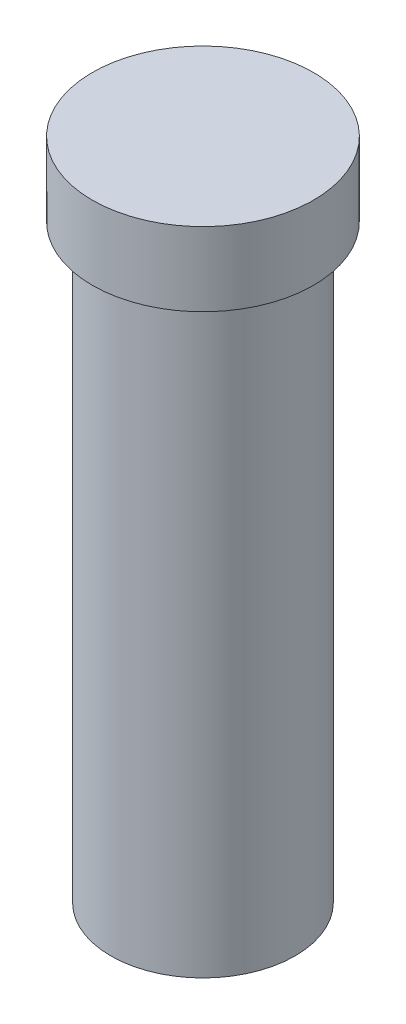
ISO-10303-21;
HEADER;
FILE_DESCRIPTION(('STEP AP214'),'2;1');
FILE_NAME('part.step','',(''),(''),'','','');
FILE_SCHEMA(('AUTOMOTIVE_DESIGN { 1 0 10303 214 1 1 1 1 }'));
ENDSEC;
DATA;
#1=APPLICATION_CONTEXT('core data for automotive mechanical design processes');
#2=APPLICATION_PROTOCOL_DEFINITION('international standard','automotive_design',2000,#1);
#3=PRODUCT_CONTEXT('',#1,'mechanical');
#4=PRODUCT('Part','Part','',(#3));
#5=PRODUCT_RELATED_PRODUCT_CATEGORY('part','',(#4));
#6=PRODUCT_DEFINITION_FORMATION('','',#4);
#7=PRODUCT_DEFINITION_CONTEXT('part definition',#1,'design');
#8=PRODUCT_DEFINITION('design','',#6,#7);
#9=PRODUCT_DEFINITION_SHAPE('','',#8);
#10=(LENGTH_UNIT() NAMED_UNIT(*) SI_UNIT(.MILLI.,.METRE.));
#11=(NAMED_UNIT(*) PLANE_ANGLE_UNIT() SI_UNIT($,.RADIAN.));
#12=(NAMED_UNIT(*) SI_UNIT($,.STERADIAN.) SOLID_ANGLE_UNIT());
#13=UNCERTAINTY_MEASURE_WITH_UNIT(LENGTH_MEASURE(1.E-05),#10,'distance_accuracy_value','');
#14=(GEOMETRIC_REPRESENTATION_CONTEXT(3) GLOBAL_UNCERTAINTY_ASSIGNED_CONTEXT((#13)) GLOBAL_UNIT_ASSIGNED_CONTEXT((#10,
#11,#12)) REPRESENTATION_CONTEXT('',''));
#15=CARTESIAN_POINT('',(0.,0.,0.));
#16=DIRECTION('',(0.,0.,1.));
#17=DIRECTION('',(1.,0.,0.));
#18=AXIS2_PLACEMENT_3D('',#15,#16,#17);
#19=CARTESIAN_POINT('',(0.,45.,0.));
#20=DIRECTION('',(0.,-1.,0.));
#21=DIRECTION('',(0.,0.,-1.));
#22=AXIS2_PLACEMENT_3D('',#19,#20,#21);
#23=CYLINDRICAL_SURFACE('',#22,12.5);
#24=CARTESIAN_POINT('',(0.,-45.,0.));
#25=DIRECTION('',(0.,1.,0.));
#26=DIRECTION('',(0.,0.,1.));
#27=AXIS2_PLACEMENT_3D('',#24,#25,#26);
#28=CIRCLE('',#27,12.5);
#29=CARTESIAN_POINT('',(0.,-45.,12.5));
#30=VERTEX_POINT('',#29);
#31=EDGE_CURVE('E43',#30,#30,#28,.T.);
#32=ORIENTED_EDGE('',*,*,#31,.T.);
#33=EDGE_LOOP('',(#32));
#34=FACE_BOUND('',#33,.T.);
#35=CARTESIAN_POINT('',(0.,35.,0.));
#36=DIRECTION('',(0.,1.,0.));
#37=DIRECTION('',(0.,0.,1.));
#38=AXIS2_PLACEMENT_3D('',#35,#36,#37);
#39=CIRCLE('',#38,12.5);
#40=CARTESIAN_POINT('',(0.,35.,12.5));
#41=VERTEX_POINT('',#40);
#42=EDGE_CURVE('E10',#41,#41,#39,.T.);
#43=ORIENTED_EDGE('',*,*,#42,.F.);
#44=EDGE_LOOP('',(#43));
#45=FACE_BOUND('',#44,.T.);
#46=ADVANCED_FACE('F37',(#34,#45),#23,.T.);
#47=CARTESIAN_POINT('',(0.,-45.,0.));
#48=DIRECTION('',(0.,1.,0.));
#49=DIRECTION('',(0.,0.,1.));
#50=AXIS2_PLACEMENT_3D('',#47,#48,#49);
#51=PLANE('',#50);
#52=ORIENTED_EDGE('',*,*,#31,.F.);
#53=EDGE_LOOP('',(#52));
#54=FACE_BOUND('',#53,.T.);
#55=ADVANCED_FACE('F62',(#54),#51,.F.);
#56=CARTESIAN_POINT('',(0.,35.,0.));
#57=DIRECTION('',(0.,1.,0.));
#58=DIRECTION('',(0.,0.,1.));
#59=AXIS2_PLACEMENT_3D('',#56,#57,#58);
#60=CYLINDRICAL_SURFACE('',#59,15.);
#61=CARTESIAN_POINT('',(0.,35.,0.));
#62=DIRECTION('',(0.,1.,0.));
#63=DIRECTION('',(0.,0.,1.));
#64=AXIS2_PLACEMENT_3D('',#61,#62,#63);
#65=CIRCLE('',#64,15.);
#66=CARTESIAN_POINT('',(0.,35.,15.));
#67=VERTEX_POINT('',#66);
#68=EDGE_CURVE('E47',#67,#67,#65,.T.);
#69=ORIENTED_EDGE('',*,*,#68,.T.);
#70=EDGE_LOOP('',(#69));
#71=FACE_BOUND('',#70,.T.);
#72=CARTESIAN_POINT('',(0.,45.,0.));
#73=DIRECTION('',(0.,1.,0.));
#74=DIRECTION('',(0.,0.,1.));
#75=AXIS2_PLACEMENT_3D('',#72,#73,#74);
#76=CIRCLE('',#75,15.);
#77=CARTESIAN_POINT('',(0.,45.,15.));
#78=VERTEX_POINT('',#77);
#79=EDGE_CURVE('E51',#78,#78,#76,.T.);
#80=ORIENTED_EDGE('',*,*,#79,.F.);
#81=EDGE_LOOP('',(#80));
#82=FACE_BOUND('',#81,.T.);
#83=ADVANCED_FACE('F59',(#71,#82),#60,.T.);
#84=CARTESIAN_POINT('',(0.,35.,0.));
#85=DIRECTION('',(0.,1.,0.));
#86=DIRECTION('',(0.,0.,1.));
#87=AXIS2_PLACEMENT_3D('',#84,#85,#86);
#88=PLANE('',#87);
#89=ORIENTED_EDGE('',*,*,#42,.T.);
#90=EDGE_LOOP('',(#89));
#91=FACE_BOUND('',#90,.T.);
#92=ORIENTED_EDGE('',*,*,#68,.F.);
#93=EDGE_LOOP('',(#92));
#94=FACE_BOUND('',#93,.T.);
#95=ADVANCED_FACE('F61',(#91,#94),#88,.F.);
#96=CARTESIAN_POINT('',(0.,45.,0.));
#97=DIRECTION('',(0.,1.,0.));
#98=DIRECTION('',(0.,0.,1.));
#99=AXIS2_PLACEMENT_3D('',#96,#97,#98);
#100=PLANE('',#99);
#101=ORIENTED_EDGE('',*,*,#79,.T.);
#102=EDGE_LOOP('',(#101));
#103=FACE_BOUND('',#102,.T.);
#104=ADVANCED_FACE('F57',(#103),#100,.T.);
#105=CLOSED_SHELL('',(#46,#55,#83,#95,#104));
#106=MANIFOLD_SOLID_BREP('B2',#105);
#107=ADVANCED_BREP_SHAPE_REPRESENTATION('',(#18,#106),#14);
#108=SHAPE_DEFINITION_REPRESENTATION(#9,#107);
ENDSEC;
END-ISO-10303-21;
